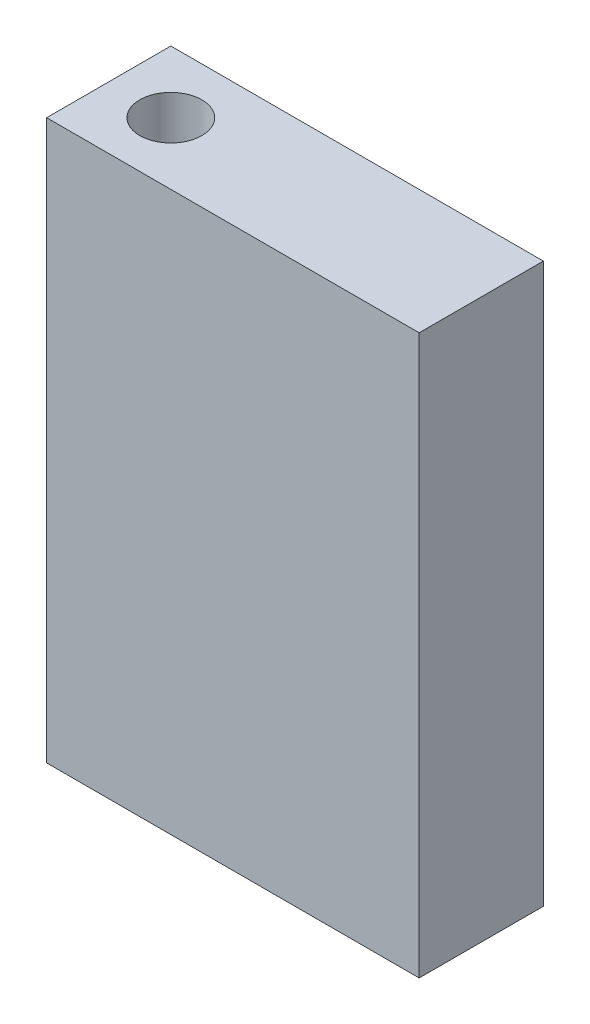
ISO-10303-21;
HEADER;
FILE_DESCRIPTION(('STEP AP214'),'2;1');
FILE_NAME('part.step','',(''),(''),'','','');
FILE_SCHEMA(('AUTOMOTIVE_DESIGN { 1 0 10303 214 1 1 1 1 }'));
ENDSEC;
DATA;
#1=APPLICATION_CONTEXT('core data for automotive mechanical design processes');
#2=APPLICATION_PROTOCOL_DEFINITION('international standard','automotive_design',2000,#1);
#3=PRODUCT_CONTEXT('',#1,'mechanical');
#4=PRODUCT('Part','Part','',(#3));
#5=PRODUCT_RELATED_PRODUCT_CATEGORY('part','',(#4));
#6=PRODUCT_DEFINITION_FORMATION('','',#4);
#7=PRODUCT_DEFINITION_CONTEXT('part definition',#1,'design');
#8=PRODUCT_DEFINITION('design','',#6,#7);
#9=PRODUCT_DEFINITION_SHAPE('','',#8);
#10=(LENGTH_UNIT() NAMED_UNIT(*) SI_UNIT(.MILLI.,.METRE.));
#11=(NAMED_UNIT(*) PLANE_ANGLE_UNIT() SI_UNIT($,.RADIAN.));
#12=(NAMED_UNIT(*) SI_UNIT($,.STERADIAN.) SOLID_ANGLE_UNIT());
#13=UNCERTAINTY_MEASURE_WITH_UNIT(LENGTH_MEASURE(1.E-05),#10,'distance_accuracy_value','');
#14=(GEOMETRIC_REPRESENTATION_CONTEXT(3) GLOBAL_UNCERTAINTY_ASSIGNED_CONTEXT((#13)) GLOBAL_UNIT_ASSIGNED_CONTEXT((#10,
#11,#12)) REPRESENTATION_CONTEXT('',''));
#15=CARTESIAN_POINT('',(0.,0.,0.));
#16=DIRECTION('',(0.,0.,1.));
#17=DIRECTION('',(1.,0.,0.));
#18=AXIS2_PLACEMENT_3D('',#15,#16,#17);
#19=CARTESIAN_POINT('',(-23.0206570943778,45.,-17.3303034493892));
#20=DIRECTION('',(1.,0.,0.));
#21=DIRECTION('',(0.,0.,-1.));
#22=AXIS2_PLACEMENT_3D('',#19,#20,#21);
#23=PLANE('',#22);
#24=DIRECTION('',(0.,0.,1.));
#25=VECTOR('',#24,1.);
#26=CARTESIAN_POINT('',(-23.0206570943778,0.,-17.3303034493892));
#27=LINE('',#26,#25);
#28=CARTESIAN_POINT('',(-23.0206570943778,0.,-27.3303034493892));
#29=VERTEX_POINT('',#28);
#30=CARTESIAN_POINT('',(-23.0206570943778,0.,-17.3303034493892));
#31=VERTEX_POINT('',#30);
#32=EDGE_CURVE('E107',#29,#31,#27,.T.);
#33=ORIENTED_EDGE('',*,*,#32,.T.);
#34=DIRECTION('',(0.,-1.,0.));
#35=VECTOR('',#34,1.);
#36=CARTESIAN_POINT('',(-23.0206570943778,45.,-17.3303034493892));
#37=LINE('',#36,#35);
#38=CARTESIAN_POINT('',(-23.0206570943778,45.,-17.3303034493892));
#39=VERTEX_POINT('',#38);
#40=EDGE_CURVE('E11',#39,#31,#37,.T.);
#41=ORIENTED_EDGE('',*,*,#40,.F.);
#42=DIRECTION('',(0.,0.,1.));
#43=VECTOR('',#42,1.);
#44=CARTESIAN_POINT('',(-23.0206570943778,45.,-17.3303034493892));
#45=LINE('',#44,#43);
#46=CARTESIAN_POINT('',(-23.0206570943778,45.,-27.3303034493892));
#47=VERTEX_POINT('',#46);
#48=EDGE_CURVE('E91',#47,#39,#45,.T.);
#49=ORIENTED_EDGE('',*,*,#48,.F.);
#50=DIRECTION('',(0.,-1.,0.));
#51=VECTOR('',#50,1.);
#52=CARTESIAN_POINT('',(-23.0206570943778,45.,-27.3303034493892));
#53=LINE('',#52,#51);
#54=EDGE_CURVE('E103',#47,#29,#53,.T.);
#55=ORIENTED_EDGE('',*,*,#54,.T.);
#56=EDGE_LOOP('',(#33,#41,#49,#55));
#57=FACE_BOUND('',#56,.T.);
#58=ADVANCED_FACE('F39',(#57),#23,.F.);
#59=CARTESIAN_POINT('',(-23.0206570943778,45.,-17.3303034493892));
#60=DIRECTION('',(0.,0.,-1.));
#61=DIRECTION('',(-1.,0.,0.));
#62=AXIS2_PLACEMENT_3D('',#59,#60,#61);
#63=PLANE('',#62);
#64=DIRECTION('',(1.,0.,0.));
#65=VECTOR('',#64,1.);
#66=CARTESIAN_POINT('',(-23.0206570943778,0.,-17.3303034493892));
#67=LINE('',#66,#65);
#68=CARTESIAN_POINT('',(6.97934290562216,0.,-17.3303034493892));
#69=VERTEX_POINT('',#68);
#70=EDGE_CURVE('E96',#31,#69,#67,.T.);
#71=ORIENTED_EDGE('',*,*,#70,.T.);
#72=DIRECTION('',(0.,-1.,0.));
#73=VECTOR('',#72,1.);
#74=CARTESIAN_POINT('',(6.97934290562216,45.,-17.3303034493892));
#75=LINE('',#74,#73);
#76=CARTESIAN_POINT('',(6.97934290562216,45.,-17.3303034493892));
#77=VERTEX_POINT('',#76);
#78=EDGE_CURVE('E48',#77,#69,#75,.T.);
#79=ORIENTED_EDGE('',*,*,#78,.F.);
#80=DIRECTION('',(1.,0.,0.));
#81=VECTOR('',#80,1.);
#82=CARTESIAN_POINT('',(-23.0206570943778,45.,-17.3303034493892));
#83=LINE('',#82,#81);
#84=EDGE_CURVE('E86',#39,#77,#83,.T.);
#85=ORIENTED_EDGE('',*,*,#84,.F.);
#86=ORIENTED_EDGE('',*,*,#40,.T.);
#87=EDGE_LOOP('',(#71,#79,#85,#86));
#88=FACE_BOUND('',#87,.T.);
#89=ADVANCED_FACE('F95',(#88),#63,.F.);
#90=CARTESIAN_POINT('',(6.97934290562216,45.,-17.3303034493892));
#91=DIRECTION('',(-1.,0.,0.));
#92=DIRECTION('',(0.,0.,1.));
#93=AXIS2_PLACEMENT_3D('',#90,#91,#92);
#94=PLANE('',#93);
#95=DIRECTION('',(0.,0.,-1.));
#96=VECTOR('',#95,1.);
#97=CARTESIAN_POINT('',(6.97934290562216,0.,-17.3303034493892));
#98=LINE('',#97,#96);
#99=CARTESIAN_POINT('',(6.97934290562216,0.,-27.3303034493892));
#100=VERTEX_POINT('',#99);
#101=EDGE_CURVE('E73',#69,#100,#98,.T.);
#102=ORIENTED_EDGE('',*,*,#101,.T.);
#103=DIRECTION('',(0.,-1.,0.));
#104=VECTOR('',#103,1.);
#105=CARTESIAN_POINT('',(6.97934290562216,45.,-27.3303034493892));
#106=LINE('',#105,#104);
#107=CARTESIAN_POINT('',(6.97934290562216,45.,-27.3303034493892));
#108=VERTEX_POINT('',#107);
#109=EDGE_CURVE('E98',#108,#100,#106,.T.);
#110=ORIENTED_EDGE('',*,*,#109,.F.);
#111=DIRECTION('',(0.,0.,-1.));
#112=VECTOR('',#111,1.);
#113=CARTESIAN_POINT('',(6.97934290562216,45.,-17.3303034493892));
#114=LINE('',#113,#112);
#115=EDGE_CURVE('E89',#77,#108,#114,.T.);
#116=ORIENTED_EDGE('',*,*,#115,.F.);
#117=ORIENTED_EDGE('',*,*,#78,.T.);
#118=EDGE_LOOP('',(#102,#110,#116,#117));
#119=FACE_BOUND('',#118,.T.);
#120=ADVANCED_FACE('F99',(#119),#94,.F.);
#121=CARTESIAN_POINT('',(-23.0206570943778,45.,-27.3303034493892));
#122=DIRECTION('',(0.,0.,1.));
#123=DIRECTION('',(1.,0.,0.));
#124=AXIS2_PLACEMENT_3D('',#121,#122,#123);
#125=PLANE('',#124);
#126=DIRECTION('',(-1.,0.,0.));
#127=VECTOR('',#126,1.);
#128=CARTESIAN_POINT('',(-23.0206570943778,0.,-27.3303034493892));
#129=LINE('',#128,#127);
#130=EDGE_CURVE('E79',#100,#29,#129,.T.);
#131=ORIENTED_EDGE('',*,*,#130,.T.);
#132=ORIENTED_EDGE('',*,*,#54,.F.);
#133=DIRECTION('',(-1.,0.,0.));
#134=VECTOR('',#133,1.);
#135=CARTESIAN_POINT('',(-23.0206570943778,45.,-27.3303034493892));
#136=LINE('',#135,#134);
#137=EDGE_CURVE('E56',#108,#47,#136,.T.);
#138=ORIENTED_EDGE('',*,*,#137,.F.);
#139=ORIENTED_EDGE('',*,*,#109,.T.);
#140=EDGE_LOOP('',(#131,#132,#138,#139));
#141=FACE_BOUND('',#140,.T.);
#142=ADVANCED_FACE('F121',(#141),#125,.F.);
#143=CARTESIAN_POINT('',(0.,45.,0.));
#144=DIRECTION('',(0.,-1.,0.));
#145=DIRECTION('',(0.,0.,-1.));
#146=AXIS2_PLACEMENT_3D('',#143,#144,#145);
#147=PLANE('',#146);
#148=CARTESIAN_POINT('',(-18.0206570943778,45.,-22.3303034493892));
#149=DIRECTION('',(0.,1.,0.));
#150=DIRECTION('',(0.,0.,1.));
#151=AXIS2_PLACEMENT_3D('',#148,#149,#150);
#152=CIRCLE('',#151,2.5);
#153=CARTESIAN_POINT('',(-18.0206570943778,45.,-19.8303034493892));
#154=VERTEX_POINT('',#153);
#155=EDGE_CURVE('E128',#154,#154,#152,.T.);
#156=ORIENTED_EDGE('',*,*,#155,.F.);
#157=EDGE_LOOP('',(#156));
#158=FACE_BOUND('',#157,.T.);
#159=ORIENTED_EDGE('',*,*,#48,.T.);
#160=ORIENTED_EDGE('',*,*,#84,.T.);
#161=ORIENTED_EDGE('',*,*,#115,.T.);
#162=ORIENTED_EDGE('',*,*,#137,.T.);
#163=EDGE_LOOP('',(#159,#160,#161,#162));
#164=FACE_BOUND('',#163,.T.);
#165=ADVANCED_FACE('F87',(#158,#164),#147,.F.);
#166=CARTESIAN_POINT('',(0.,0.,0.));
#167=DIRECTION('',(0.,-1.,0.));
#168=DIRECTION('',(0.,0.,-1.));
#169=AXIS2_PLACEMENT_3D('',#166,#167,#168);
#170=PLANE('',#169);
#171=ORIENTED_EDGE('',*,*,#32,.F.);
#172=ORIENTED_EDGE('',*,*,#130,.F.);
#173=ORIENTED_EDGE('',*,*,#101,.F.);
#174=ORIENTED_EDGE('',*,*,#70,.F.);
#175=EDGE_LOOP('',(#171,#172,#173,#174));
#176=FACE_BOUND('',#175,.T.);
#177=ADVANCED_FACE('F124',(#176),#170,.T.);
#178=CARTESIAN_POINT('',(-18.0206570943778,9.99999999999999,-22.3303034493892));
#179=DIRECTION('',(0.,1.,0.));
#180=DIRECTION('',(0.,0.,1.));
#181=AXIS2_PLACEMENT_3D('',#178,#179,#180);
#182=CYLINDRICAL_SURFACE('',#181,2.5);
#183=CARTESIAN_POINT('',(-18.0206570943778,9.99999999999999,-22.3303034493892));
#184=DIRECTION('',(0.,1.,0.));
#185=DIRECTION('',(0.,0.,1.));
#186=AXIS2_PLACEMENT_3D('',#183,#184,#185);
#187=CIRCLE('',#186,2.5);
#188=CARTESIAN_POINT('',(-18.0206570943778,9.99999999999999,-19.8303034493892));
#189=VERTEX_POINT('',#188);
#190=EDGE_CURVE('E111',#189,#189,#187,.T.);
#191=ORIENTED_EDGE('',*,*,#190,.F.);
#192=EDGE_LOOP('',(#191));
#193=FACE_BOUND('',#192,.T.);
#194=ORIENTED_EDGE('',*,*,#155,.T.);
#195=EDGE_LOOP('',(#194));
#196=FACE_BOUND('',#195,.T.);
#197=ADVANCED_FACE('F138',(#193,#196),#182,.F.);
#198=CARTESIAN_POINT('',(-18.0206570943778,9.99999999999999,-22.3303034493892));
#199=DIRECTION('',(0.,1.,0.));
#200=DIRECTION('',(0.,0.,1.));
#201=AXIS2_PLACEMENT_3D('',#198,#199,#200);
#202=PLANE('',#201);
#203=ORIENTED_EDGE('',*,*,#190,.T.);
#204=EDGE_LOOP('',(#203));
#205=FACE_BOUND('',#204,.T.);
#206=ADVANCED_FACE('F136',(#205),#202,.T.);
#207=CLOSED_SHELL('',(#58,#89,#120,#142,#165,#177,#197,#206));
#208=MANIFOLD_SOLID_BREP('B2',#207);
#209=ADVANCED_BREP_SHAPE_REPRESENTATION('',(#18,#208),#14);
#210=SHAPE_DEFINITION_REPRESENTATION(#9,#209);
ENDSEC;
END-ISO-10303-21;
